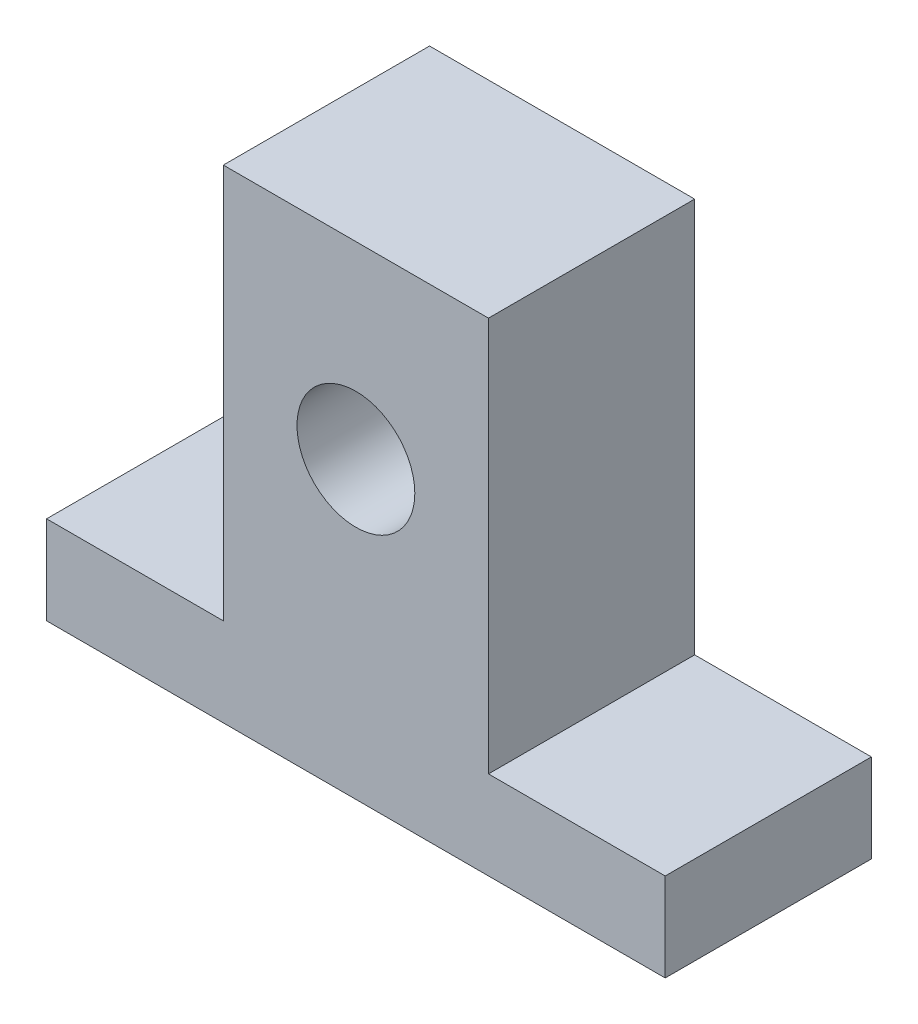
ISO-10303-21;
HEADER;
FILE_DESCRIPTION(('STEP AP214'),'2;1');
FILE_NAME('part.step','',(''),(''),'','','');
FILE_SCHEMA(('AUTOMOTIVE_DESIGN { 1 0 10303 214 1 1 1 1 }'));
ENDSEC;
DATA;
#1=APPLICATION_CONTEXT('core data for automotive mechanical design processes');
#2=APPLICATION_PROTOCOL_DEFINITION('international standard','automotive_design',2000,#1);
#3=PRODUCT_CONTEXT('',#1,'mechanical');
#4=PRODUCT('Part','Part','',(#3));
#5=PRODUCT_RELATED_PRODUCT_CATEGORY('part','',(#4));
#6=PRODUCT_DEFINITION_FORMATION('','',#4);
#7=PRODUCT_DEFINITION_CONTEXT('part definition',#1,'design');
#8=PRODUCT_DEFINITION('design','',#6,#7);
#9=PRODUCT_DEFINITION_SHAPE('','',#8);
#10=(LENGTH_UNIT() NAMED_UNIT(*) SI_UNIT(.MILLI.,.METRE.));
#11=(NAMED_UNIT(*) PLANE_ANGLE_UNIT() SI_UNIT($,.RADIAN.));
#12=(NAMED_UNIT(*) SI_UNIT($,.STERADIAN.) SOLID_ANGLE_UNIT());
#13=UNCERTAINTY_MEASURE_WITH_UNIT(LENGTH_MEASURE(1.E-05),#10,'distance_accuracy_value','');
#14=(GEOMETRIC_REPRESENTATION_CONTEXT(3) GLOBAL_UNCERTAINTY_ASSIGNED_CONTEXT((#13)) GLOBAL_UNIT_ASSIGNED_CONTEXT((#10,
#11,#12)) REPRESENTATION_CONTEXT('',''));
#15=CARTESIAN_POINT('',(0.,0.,0.));
#16=DIRECTION('',(0.,0.,1.));
#17=DIRECTION('',(1.,0.,0.));
#18=AXIS2_PLACEMENT_3D('',#15,#16,#17);
#19=CARTESIAN_POINT('',(0.,0.,14.));
#20=DIRECTION('',(0.,0.,1.));
#21=DIRECTION('',(1.,0.,0.));
#22=AXIS2_PLACEMENT_3D('',#19,#20,#21);
#23=PLANE('',#22);
#24=DIRECTION('',(0.,-1.,0.));
#25=VECTOR('',#24,1.);
#26=CARTESIAN_POINT('',(0.,6.,14.));
#27=LINE('',#26,#25);
#28=CARTESIAN_POINT('',(0.,6.,14.));
#29=VERTEX_POINT('',#28);
#30=CARTESIAN_POINT('',(0.,0.,14.));
#31=VERTEX_POINT('',#30);
#32=EDGE_CURVE('E144',#29,#31,#27,.T.);
#33=ORIENTED_EDGE('',*,*,#32,.T.);
#34=DIRECTION('',(1.,0.,0.));
#35=VECTOR('',#34,1.);
#36=CARTESIAN_POINT('',(0.,0.,14.));
#37=LINE('',#36,#35);
#38=CARTESIAN_POINT('',(42.,0.,14.));
#39=VERTEX_POINT('',#38);
#40=EDGE_CURVE('E92',#31,#39,#37,.T.);
#41=ORIENTED_EDGE('',*,*,#40,.T.);
#42=DIRECTION('',(0.,1.,0.));
#43=VECTOR('',#42,1.);
#44=CARTESIAN_POINT('',(42.,0.,14.));
#45=LINE('',#44,#43);
#46=CARTESIAN_POINT('',(42.,6.,14.));
#47=VERTEX_POINT('',#46);
#48=EDGE_CURVE('E159',#39,#47,#45,.T.);
#49=ORIENTED_EDGE('',*,*,#48,.T.);
#50=DIRECTION('',(-1.,0.,0.));
#51=VECTOR('',#50,1.);
#52=CARTESIAN_POINT('',(42.,6.,14.));
#53=LINE('',#52,#51);
#54=CARTESIAN_POINT('',(30.,6.,14.));
#55=VERTEX_POINT('',#54);
#56=EDGE_CURVE('E172',#47,#55,#53,.T.);
#57=ORIENTED_EDGE('',*,*,#56,.T.);
#58=DIRECTION('',(0.,1.,0.));
#59=VECTOR('',#58,1.);
#60=CARTESIAN_POINT('',(30.,6.,14.));
#61=LINE('',#60,#59);
#62=CARTESIAN_POINT('',(30.,32.8,14.));
#63=VERTEX_POINT('',#62);
#64=EDGE_CURVE('E111',#55,#63,#61,.T.);
#65=ORIENTED_EDGE('',*,*,#64,.T.);
#66=DIRECTION('',(-1.,0.,0.));
#67=VECTOR('',#66,1.);
#68=CARTESIAN_POINT('',(30.,32.8,14.));
#69=LINE('',#68,#67);
#70=CARTESIAN_POINT('',(12.,32.8,14.));
#71=VERTEX_POINT('',#70);
#72=EDGE_CURVE('E105',#63,#71,#69,.T.);
#73=ORIENTED_EDGE('',*,*,#72,.T.);
#74=DIRECTION('',(0.,-1.,0.));
#75=VECTOR('',#74,1.);
#76=CARTESIAN_POINT('',(12.,32.8,14.));
#77=LINE('',#76,#75);
#78=CARTESIAN_POINT('',(12.,6.,14.));
#79=VERTEX_POINT('',#78);
#80=EDGE_CURVE('E109',#71,#79,#77,.T.);
#81=ORIENTED_EDGE('',*,*,#80,.T.);
#82=DIRECTION('',(-1.,0.,0.));
#83=VECTOR('',#82,1.);
#84=CARTESIAN_POINT('',(12.,6.,14.));
#85=LINE('',#84,#83);
#86=EDGE_CURVE('E49',#79,#29,#85,.T.);
#87=ORIENTED_EDGE('',*,*,#86,.T.);
#88=EDGE_LOOP('',(#33,#41,#49,#57,#65,#73,#81,#87));
#89=FACE_BOUND('',#88,.T.);
#90=CARTESIAN_POINT('',(21.,20.,14.));
#91=DIRECTION('',(0.,0.,1.));
#92=DIRECTION('',(1.,0.,0.));
#93=AXIS2_PLACEMENT_3D('',#90,#91,#92);
#94=CIRCLE('',#93,4.);
#95=CARTESIAN_POINT('',(25.,20.,14.));
#96=VERTEX_POINT('',#95);
#97=EDGE_CURVE('E133',#96,#96,#94,.T.);
#98=ORIENTED_EDGE('',*,*,#97,.F.);
#99=EDGE_LOOP('',(#98));
#100=FACE_BOUND('',#99,.T.);
#101=ADVANCED_FACE('F32',(#89,#100),#23,.T.);
#102=CARTESIAN_POINT('',(0.,0.,0.));
#103=DIRECTION('',(0.,0.,1.));
#104=DIRECTION('',(1.,0.,0.));
#105=AXIS2_PLACEMENT_3D('',#102,#103,#104);
#106=PLANE('',#105);
#107=DIRECTION('',(0.,-1.,0.));
#108=VECTOR('',#107,1.);
#109=CARTESIAN_POINT('',(0.,6.,0.));
#110=LINE('',#109,#108);
#111=CARTESIAN_POINT('',(0.,6.,0.));
#112=VERTEX_POINT('',#111);
#113=CARTESIAN_POINT('',(0.,0.,0.));
#114=VERTEX_POINT('',#113);
#115=EDGE_CURVE('E129',#112,#114,#110,.T.);
#116=ORIENTED_EDGE('',*,*,#115,.F.);
#117=DIRECTION('',(-1.,0.,0.));
#118=VECTOR('',#117,1.);
#119=CARTESIAN_POINT('',(12.,6.,0.));
#120=LINE('',#119,#118);
#121=CARTESIAN_POINT('',(12.,6.,0.));
#122=VERTEX_POINT('',#121);
#123=EDGE_CURVE('E84',#122,#112,#120,.T.);
#124=ORIENTED_EDGE('',*,*,#123,.F.);
#125=DIRECTION('',(0.,-1.,0.));
#126=VECTOR('',#125,1.);
#127=CARTESIAN_POINT('',(12.,32.8,0.));
#128=LINE('',#127,#126);
#129=CARTESIAN_POINT('',(12.,32.8,0.));
#130=VERTEX_POINT('',#129);
#131=EDGE_CURVE('E78',#130,#122,#128,.T.);
#132=ORIENTED_EDGE('',*,*,#131,.F.);
#133=DIRECTION('',(-1.,0.,0.));
#134=VECTOR('',#133,1.);
#135=CARTESIAN_POINT('',(30.,32.8,0.));
#136=LINE('',#135,#134);
#137=CARTESIAN_POINT('',(30.,32.8,0.));
#138=VERTEX_POINT('',#137);
#139=EDGE_CURVE('E119',#138,#130,#136,.T.);
#140=ORIENTED_EDGE('',*,*,#139,.F.);
#141=DIRECTION('',(0.,1.,0.));
#142=VECTOR('',#141,1.);
#143=CARTESIAN_POINT('',(30.,6.,0.));
#144=LINE('',#143,#142);
#145=CARTESIAN_POINT('',(30.,6.,0.));
#146=VERTEX_POINT('',#145);
#147=EDGE_CURVE('E139',#146,#138,#144,.T.);
#148=ORIENTED_EDGE('',*,*,#147,.F.);
#149=DIRECTION('',(-1.,0.,0.));
#150=VECTOR('',#149,1.);
#151=CARTESIAN_POINT('',(42.,6.,0.));
#152=LINE('',#151,#150);
#153=CARTESIAN_POINT('',(42.,6.,0.));
#154=VERTEX_POINT('',#153);
#155=EDGE_CURVE('E137',#154,#146,#152,.T.);
#156=ORIENTED_EDGE('',*,*,#155,.F.);
#157=DIRECTION('',(0.,1.,0.));
#158=VECTOR('',#157,1.);
#159=CARTESIAN_POINT('',(42.,0.,0.));
#160=LINE('',#159,#158);
#161=CARTESIAN_POINT('',(42.,0.,0.));
#162=VERTEX_POINT('',#161);
#163=EDGE_CURVE('E135',#162,#154,#160,.T.);
#164=ORIENTED_EDGE('',*,*,#163,.F.);
#165=DIRECTION('',(1.,0.,0.));
#166=VECTOR('',#165,1.);
#167=CARTESIAN_POINT('',(0.,0.,0.));
#168=LINE('',#167,#166);
#169=EDGE_CURVE('E132',#114,#162,#168,.T.);
#170=ORIENTED_EDGE('',*,*,#169,.F.);
#171=EDGE_LOOP('',(#116,#124,#132,#140,#148,#156,#164,#170));
#172=FACE_BOUND('',#171,.T.);
#173=CARTESIAN_POINT('',(21.,20.,0.));
#174=DIRECTION('',(0.,0.,1.));
#175=DIRECTION('',(1.,0.,0.));
#176=AXIS2_PLACEMENT_3D('',#173,#174,#175);
#177=CIRCLE('',#176,4.);
#178=CARTESIAN_POINT('',(25.,20.,0.));
#179=VERTEX_POINT('',#178);
#180=EDGE_CURVE('E178',#179,#179,#177,.T.);
#181=ORIENTED_EDGE('',*,*,#180,.T.);
#182=EDGE_LOOP('',(#181));
#183=FACE_BOUND('',#182,.T.);
#184=ADVANCED_FACE('F163',(#172,#183),#106,.F.);
#185=CARTESIAN_POINT('',(0.,6.,14.));
#186=DIRECTION('',(1.,0.,0.));
#187=DIRECTION('',(0.,0.,-1.));
#188=AXIS2_PLACEMENT_3D('',#185,#186,#187);
#189=PLANE('',#188);
#190=ORIENTED_EDGE('',*,*,#115,.T.);
#191=DIRECTION('',(0.,0.,-1.));
#192=VECTOR('',#191,1.);
#193=CARTESIAN_POINT('',(0.,0.,14.));
#194=LINE('',#193,#192);
#195=EDGE_CURVE('E11',#31,#114,#194,.T.);
#196=ORIENTED_EDGE('',*,*,#195,.F.);
#197=ORIENTED_EDGE('',*,*,#32,.F.);
#198=DIRECTION('',(0.,0.,-1.));
#199=VECTOR('',#198,1.);
#200=CARTESIAN_POINT('',(0.,6.,14.));
#201=LINE('',#200,#199);
#202=EDGE_CURVE('E125',#29,#112,#201,.T.);
#203=ORIENTED_EDGE('',*,*,#202,.T.);
#204=EDGE_LOOP('',(#190,#196,#197,#203));
#205=FACE_BOUND('',#204,.T.);
#206=ADVANCED_FACE('F34',(#205),#189,.F.);
#207=CARTESIAN_POINT('',(0.,0.,14.));
#208=DIRECTION('',(0.,1.,0.));
#209=DIRECTION('',(0.,0.,1.));
#210=AXIS2_PLACEMENT_3D('',#207,#208,#209);
#211=PLANE('',#210);
#212=ORIENTED_EDGE('',*,*,#169,.T.);
#213=DIRECTION('',(0.,0.,-1.));
#214=VECTOR('',#213,1.);
#215=CARTESIAN_POINT('',(42.,0.,14.));
#216=LINE('',#215,#214);
#217=EDGE_CURVE('E41',#39,#162,#216,.T.);
#218=ORIENTED_EDGE('',*,*,#217,.F.);
#219=ORIENTED_EDGE('',*,*,#40,.F.);
#220=ORIENTED_EDGE('',*,*,#195,.T.);
#221=EDGE_LOOP('',(#212,#218,#219,#220));
#222=FACE_BOUND('',#221,.T.);
#223=ADVANCED_FACE('F206',(#222),#211,.F.);
#224=CARTESIAN_POINT('',(42.,0.,14.));
#225=DIRECTION('',(-1.,0.,0.));
#226=DIRECTION('',(0.,0.,1.));
#227=AXIS2_PLACEMENT_3D('',#224,#225,#226);
#228=PLANE('',#227);
#229=ORIENTED_EDGE('',*,*,#163,.T.);
#230=DIRECTION('',(0.,0.,-1.));
#231=VECTOR('',#230,1.);
#232=CARTESIAN_POINT('',(42.,6.,14.));
#233=LINE('',#232,#231);
#234=EDGE_CURVE('E151',#47,#154,#233,.T.);
#235=ORIENTED_EDGE('',*,*,#234,.F.);
#236=ORIENTED_EDGE('',*,*,#48,.F.);
#237=ORIENTED_EDGE('',*,*,#217,.T.);
#238=EDGE_LOOP('',(#229,#235,#236,#237));
#239=FACE_BOUND('',#238,.T.);
#240=ADVANCED_FACE('F157',(#239),#228,.F.);
#241=CARTESIAN_POINT('',(42.,6.,14.));
#242=DIRECTION('',(0.,-1.,0.));
#243=DIRECTION('',(1.,0.,0.));
#244=AXIS2_PLACEMENT_3D('',#241,#242,#243);
#245=PLANE('',#244);
#246=ORIENTED_EDGE('',*,*,#155,.T.);
#247=DIRECTION('',(0.,0.,-1.));
#248=VECTOR('',#247,1.);
#249=CARTESIAN_POINT('',(30.,6.,14.));
#250=LINE('',#249,#248);
#251=EDGE_CURVE('E148',#55,#146,#250,.T.);
#252=ORIENTED_EDGE('',*,*,#251,.F.);
#253=ORIENTED_EDGE('',*,*,#56,.F.);
#254=ORIENTED_EDGE('',*,*,#234,.T.);
#255=EDGE_LOOP('',(#246,#252,#253,#254));
#256=FACE_BOUND('',#255,.T.);
#257=ADVANCED_FACE('F168',(#256),#245,.F.);
#258=CARTESIAN_POINT('',(30.,6.,14.));
#259=DIRECTION('',(-1.,0.,0.));
#260=DIRECTION('',(0.,0.,1.));
#261=AXIS2_PLACEMENT_3D('',#258,#259,#260);
#262=PLANE('',#261);
#263=ORIENTED_EDGE('',*,*,#147,.T.);
#264=DIRECTION('',(0.,0.,-1.));
#265=VECTOR('',#264,1.);
#266=CARTESIAN_POINT('',(30.,32.8,14.));
#267=LINE('',#266,#265);
#268=EDGE_CURVE('E120',#63,#138,#267,.T.);
#269=ORIENTED_EDGE('',*,*,#268,.F.);
#270=ORIENTED_EDGE('',*,*,#64,.F.);
#271=ORIENTED_EDGE('',*,*,#251,.T.);
#272=EDGE_LOOP('',(#263,#269,#270,#271));
#273=FACE_BOUND('',#272,.T.);
#274=ADVANCED_FACE('F171',(#273),#262,.F.);
#275=CARTESIAN_POINT('',(30.,32.8,14.));
#276=DIRECTION('',(0.,-1.,0.));
#277=DIRECTION('',(0.,0.,-1.));
#278=AXIS2_PLACEMENT_3D('',#275,#276,#277);
#279=PLANE('',#278);
#280=ORIENTED_EDGE('',*,*,#139,.T.);
#281=DIRECTION('',(0.,0.,-1.));
#282=VECTOR('',#281,1.);
#283=CARTESIAN_POINT('',(12.,32.8,14.));
#284=LINE('',#283,#282);
#285=EDGE_CURVE('E116',#71,#130,#284,.T.);
#286=ORIENTED_EDGE('',*,*,#285,.F.);
#287=ORIENTED_EDGE('',*,*,#72,.F.);
#288=ORIENTED_EDGE('',*,*,#268,.T.);
#289=EDGE_LOOP('',(#280,#286,#287,#288));
#290=FACE_BOUND('',#289,.T.);
#291=ADVANCED_FACE('F117',(#290),#279,.F.);
#292=CARTESIAN_POINT('',(12.,32.8,14.));
#293=DIRECTION('',(1.,0.,0.));
#294=DIRECTION('',(0.,0.,-1.));
#295=AXIS2_PLACEMENT_3D('',#292,#293,#294);
#296=PLANE('',#295);
#297=ORIENTED_EDGE('',*,*,#131,.T.);
#298=DIRECTION('',(0.,0.,-1.));
#299=VECTOR('',#298,1.);
#300=CARTESIAN_POINT('',(12.,6.,14.));
#301=LINE('',#300,#299);
#302=EDGE_CURVE('E121',#79,#122,#301,.T.);
#303=ORIENTED_EDGE('',*,*,#302,.F.);
#304=ORIENTED_EDGE('',*,*,#80,.F.);
#305=ORIENTED_EDGE('',*,*,#285,.T.);
#306=EDGE_LOOP('',(#297,#303,#304,#305));
#307=FACE_BOUND('',#306,.T.);
#308=ADVANCED_FACE('F123',(#307),#296,.F.);
#309=CARTESIAN_POINT('',(12.,6.,14.));
#310=DIRECTION('',(0.,-1.,0.));
#311=DIRECTION('',(0.,0.,-1.));
#312=AXIS2_PLACEMENT_3D('',#309,#310,#311);
#313=PLANE('',#312);
#314=ORIENTED_EDGE('',*,*,#123,.T.);
#315=ORIENTED_EDGE('',*,*,#202,.F.);
#316=ORIENTED_EDGE('',*,*,#86,.F.);
#317=ORIENTED_EDGE('',*,*,#302,.T.);
#318=EDGE_LOOP('',(#314,#315,#316,#317));
#319=FACE_BOUND('',#318,.T.);
#320=ADVANCED_FACE('F194',(#319),#313,.F.);
#321=CARTESIAN_POINT('',(21.,20.,14.));
#322=DIRECTION('',(0.,0.,-1.));
#323=DIRECTION('',(-1.,0.,0.));
#324=AXIS2_PLACEMENT_3D('',#321,#322,#323);
#325=CYLINDRICAL_SURFACE('',#324,4.);
#326=ORIENTED_EDGE('',*,*,#97,.T.);
#327=EDGE_LOOP('',(#326));
#328=FACE_BOUND('',#327,.T.);
#329=ORIENTED_EDGE('',*,*,#180,.F.);
#330=EDGE_LOOP('',(#329));
#331=FACE_BOUND('',#330,.T.);
#332=ADVANCED_FACE('F184',(#328,#331),#325,.F.);
#333=CLOSED_SHELL('',(#101,#184,#206,#223,#240,#257,#274,#291,#308,#320,#332));
#334=MANIFOLD_SOLID_BREP('B2',#333);
#335=ADVANCED_BREP_SHAPE_REPRESENTATION('',(#18,#334),#14);
#336=SHAPE_DEFINITION_REPRESENTATION(#9,#335);
ENDSEC;
END-ISO-10303-21;
